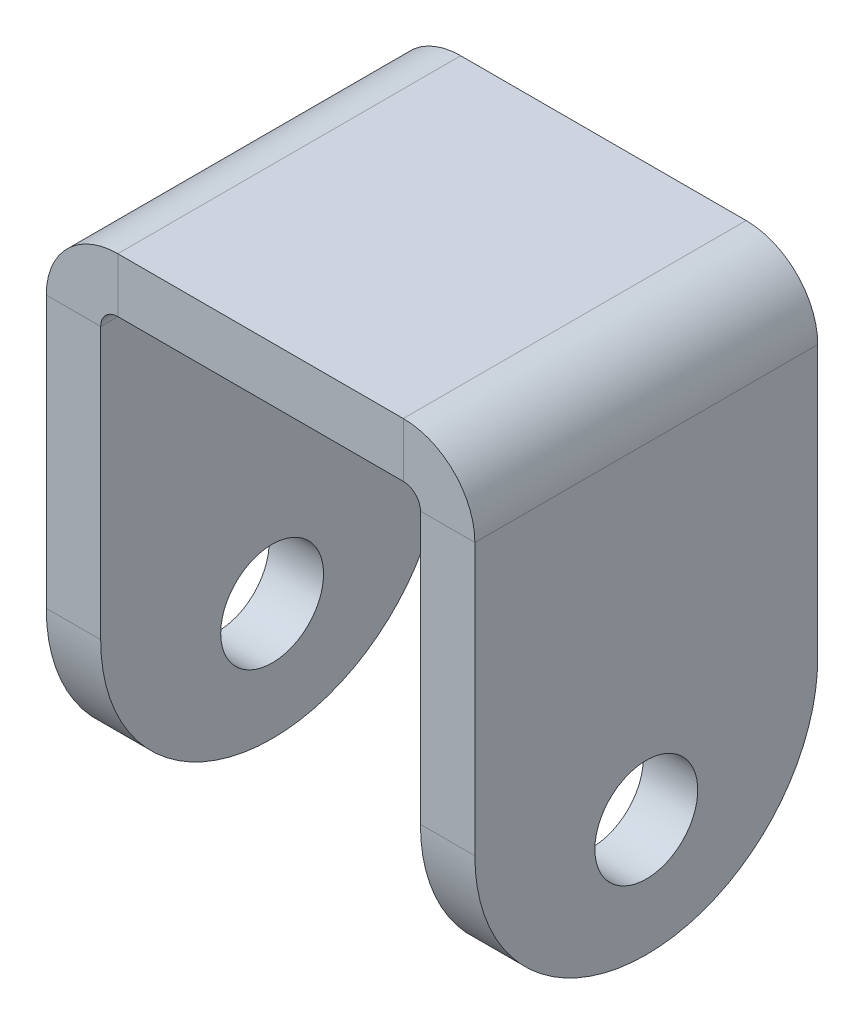
ISO-10303-21;
HEADER;
FILE_DESCRIPTION(('STEP AP214'),'2;1');
FILE_NAME('part.step','',(''),(''),'','','');
FILE_SCHEMA(('AUTOMOTIVE_DESIGN { 1 0 10303 214 1 1 1 1 }'));
ENDSEC;
DATA;
#1=APPLICATION_CONTEXT('core data for automotive mechanical design processes');
#2=APPLICATION_PROTOCOL_DEFINITION('international standard','automotive_design',2000,#1);
#3=PRODUCT_CONTEXT('',#1,'mechanical');
#4=PRODUCT('Part','Part','',(#3));
#5=PRODUCT_RELATED_PRODUCT_CATEGORY('part','',(#4));
#6=PRODUCT_DEFINITION_FORMATION('','',#4);
#7=PRODUCT_DEFINITION_CONTEXT('part definition',#1,'design');
#8=PRODUCT_DEFINITION('design','',#6,#7);
#9=PRODUCT_DEFINITION_SHAPE('','',#8);
#10=(LENGTH_UNIT() NAMED_UNIT(*) SI_UNIT(.MILLI.,.METRE.));
#11=(NAMED_UNIT(*) PLANE_ANGLE_UNIT() SI_UNIT($,.RADIAN.));
#12=(NAMED_UNIT(*) SI_UNIT($,.STERADIAN.) SOLID_ANGLE_UNIT());
#13=UNCERTAINTY_MEASURE_WITH_UNIT(LENGTH_MEASURE(1.E-05),#10,'distance_accuracy_value','');
#14=(GEOMETRIC_REPRESENTATION_CONTEXT(3) GLOBAL_UNCERTAINTY_ASSIGNED_CONTEXT((#13)) GLOBAL_UNIT_ASSIGNED_CONTEXT((#10,
#11,#12)) REPRESENTATION_CONTEXT('',''));
#15=CARTESIAN_POINT('',(0.,0.,0.));
#16=DIRECTION('',(0.,0.,1.));
#17=DIRECTION('',(1.,0.,0.));
#18=AXIS2_PLACEMENT_3D('',#15,#16,#17);
#19=CARTESIAN_POINT('',(4.175,30.,20.));
#20=DIRECTION('',(0.,0.,1.));
#21=DIRECTION('',(1.,0.,0.));
#22=AXIS2_PLACEMENT_3D('',#19,#20,#21);
#23=PLANE('',#22);
#24=DIRECTION('',(0.,-1.,0.));
#25=VECTOR('',#24,1.);
#26=CARTESIAN_POINT('',(4.175,30.,20.));
#27=LINE('',#26,#25);
#28=CARTESIAN_POINT('',(4.175,30.,20.));
#29=VERTEX_POINT('',#28);
#30=CARTESIAN_POINT('',(4.175,26.825,20.));
#31=VERTEX_POINT('',#30);
#32=EDGE_CURVE('E255',#29,#31,#27,.T.);
#33=ORIENTED_EDGE('',*,*,#32,.F.);
#34=CARTESIAN_POINT('',(4.175,25.825,20.));
#35=DIRECTION('',(0.,0.,1.));
#36=DIRECTION('',(1.,0.,0.));
#37=AXIS2_PLACEMENT_3D('',#34,#35,#36);
#38=CIRCLE('',#37,4.175);
#39=CARTESIAN_POINT('',(0.,25.825,20.));
#40=VERTEX_POINT('',#39);
#41=EDGE_CURVE('E182',#40,#29,#38,.F.);
#42=ORIENTED_EDGE('',*,*,#41,.F.);
#43=DIRECTION('',(-1.,0.,0.));
#44=VECTOR('',#43,1.);
#45=CARTESIAN_POINT('',(3.175,25.825,20.));
#46=LINE('',#45,#44);
#47=CARTESIAN_POINT('',(3.175,25.825,20.));
#48=VERTEX_POINT('',#47);
#49=EDGE_CURVE('E252',#48,#40,#46,.T.);
#50=ORIENTED_EDGE('',*,*,#49,.F.);
#51=CARTESIAN_POINT('',(4.175,25.825,20.));
#52=DIRECTION('',(0.,0.,1.));
#53=DIRECTION('',(1.,0.,0.));
#54=AXIS2_PLACEMENT_3D('',#51,#52,#53);
#55=CIRCLE('',#54,1.);
#56=EDGE_CURVE('E192',#48,#31,#55,.F.);
#57=ORIENTED_EDGE('',*,*,#56,.T.);
#58=EDGE_LOOP('',(#33,#42,#50,#57));
#59=FACE_BOUND('',#58,.T.);
#60=ADVANCED_FACE('F39',(#59),#23,.T.);
#61=CARTESIAN_POINT('',(3.175,25.825,20.));
#62=DIRECTION('',(0.,0.,1.));
#63=DIRECTION('',(1.,0.,0.));
#64=AXIS2_PLACEMENT_3D('',#61,#62,#63);
#65=PLANE('',#64);
#66=DIRECTION('',(1.,0.,0.));
#67=VECTOR('',#66,1.);
#68=CARTESIAN_POINT('',(0.,30.,20.));
#69=LINE('',#68,#67);
#70=CARTESIAN_POINT('',(20.825,30.,20.));
#71=VERTEX_POINT('',#70);
#72=EDGE_CURVE('E180',#29,#71,#69,.T.);
#73=ORIENTED_EDGE('',*,*,#72,.F.);
#74=ORIENTED_EDGE('',*,*,#32,.T.);
#75=DIRECTION('',(1.,0.,0.));
#76=VECTOR('',#75,1.);
#77=CARTESIAN_POINT('',(0.,26.825,20.));
#78=LINE('',#77,#76);
#79=CARTESIAN_POINT('',(20.825,26.825,20.));
#80=VERTEX_POINT('',#79);
#81=EDGE_CURVE('E195',#31,#80,#78,.T.);
#82=ORIENTED_EDGE('',*,*,#81,.T.);
#83=DIRECTION('',(0.,1.,0.));
#84=VECTOR('',#83,1.);
#85=CARTESIAN_POINT('',(20.825,26.825,20.));
#86=LINE('',#85,#84);
#87=EDGE_CURVE('E154',#80,#71,#86,.T.);
#88=ORIENTED_EDGE('',*,*,#87,.T.);
#89=EDGE_LOOP('',(#73,#74,#82,#88));
#90=FACE_BOUND('',#89,.T.);
#91=ADVANCED_FACE('F315',(#90),#65,.T.);
#92=CARTESIAN_POINT('',(0.,25.825,0.));
#93=DIRECTION('',(0.,0.,-1.));
#94=DIRECTION('',(-1.,0.,0.));
#95=AXIS2_PLACEMENT_3D('',#92,#93,#94);
#96=PLANE('',#95);
#97=DIRECTION('',(1.,0.,0.));
#98=VECTOR('',#97,1.);
#99=CARTESIAN_POINT('',(0.,25.825,0.));
#100=LINE('',#99,#98);
#101=CARTESIAN_POINT('',(0.,25.825,0.));
#102=VERTEX_POINT('',#101);
#103=CARTESIAN_POINT('',(3.175,25.825,0.));
#104=VERTEX_POINT('',#103);
#105=EDGE_CURVE('E249',#102,#104,#100,.T.);
#106=ORIENTED_EDGE('',*,*,#105,.F.);
#107=CARTESIAN_POINT('',(4.175,25.825,0.));
#108=DIRECTION('',(0.,0.,1.));
#109=DIRECTION('',(1.,0.,0.));
#110=AXIS2_PLACEMENT_3D('',#107,#108,#109);
#111=CIRCLE('',#110,4.175);
#112=CARTESIAN_POINT('',(4.175,30.,0.));
#113=VERTEX_POINT('',#112);
#114=EDGE_CURVE('E210',#102,#113,#111,.F.);
#115=ORIENTED_EDGE('',*,*,#114,.T.);
#116=DIRECTION('',(0.,1.,0.));
#117=VECTOR('',#116,1.);
#118=CARTESIAN_POINT('',(4.175,26.825,0.));
#119=LINE('',#118,#117);
#120=CARTESIAN_POINT('',(4.175,26.825,0.));
#121=VERTEX_POINT('',#120);
#122=EDGE_CURVE('E153',#121,#113,#119,.T.);
#123=ORIENTED_EDGE('',*,*,#122,.F.);
#124=CARTESIAN_POINT('',(4.175,25.825,0.));
#125=DIRECTION('',(0.,0.,1.));
#126=DIRECTION('',(1.,0.,0.));
#127=AXIS2_PLACEMENT_3D('',#124,#125,#126);
#128=CIRCLE('',#127,1.);
#129=EDGE_CURVE('E217',#104,#121,#128,.F.);
#130=ORIENTED_EDGE('',*,*,#129,.F.);
#131=EDGE_LOOP('',(#106,#115,#123,#130));
#132=FACE_BOUND('',#131,.T.);
#133=ADVANCED_FACE('F359',(#132),#96,.T.);
#134=CARTESIAN_POINT('',(4.175,26.825,0.));
#135=DIRECTION('',(0.,0.,-1.));
#136=DIRECTION('',(-1.,0.,0.));
#137=AXIS2_PLACEMENT_3D('',#134,#135,#136);
#138=PLANE('',#137);
#139=DIRECTION('',(0.,1.,0.));
#140=VECTOR('',#139,1.);
#141=CARTESIAN_POINT('',(3.175,0.,0.));
#142=LINE('',#141,#140);
#143=CARTESIAN_POINT('',(3.175,10.,0.));
#144=VERTEX_POINT('',#143);
#145=EDGE_CURVE('E215',#144,#104,#142,.T.);
#146=ORIENTED_EDGE('',*,*,#145,.F.);
#147=DIRECTION('',(-1.,0.,0.));
#148=VECTOR('',#147,1.);
#149=CARTESIAN_POINT('',(4.175,10.,0.));
#150=LINE('',#149,#148);
#151=CARTESIAN_POINT('',(0.,10.,0.));
#152=VERTEX_POINT('',#151);
#153=EDGE_CURVE('E272',#144,#152,#150,.T.);
#154=ORIENTED_EDGE('',*,*,#153,.T.);
#155=DIRECTION('',(0.,1.,0.));
#156=VECTOR('',#155,1.);
#157=CARTESIAN_POINT('',(0.,0.,0.));
#158=LINE('',#157,#156);
#159=EDGE_CURVE('E213',#152,#102,#158,.T.);
#160=ORIENTED_EDGE('',*,*,#159,.T.);
#161=ORIENTED_EDGE('',*,*,#105,.T.);
#162=EDGE_LOOP('',(#146,#154,#160,#161));
#163=FACE_BOUND('',#162,.T.);
#164=ADVANCED_FACE('F489',(#163),#138,.T.);
#165=CARTESIAN_POINT('',(25.,25.825,20.));
#166=DIRECTION('',(0.,0.,1.));
#167=DIRECTION('',(1.,0.,0.));
#168=AXIS2_PLACEMENT_3D('',#165,#166,#167);
#169=PLANE('',#168);
#170=DIRECTION('',(-1.,0.,0.));
#171=VECTOR('',#170,1.);
#172=CARTESIAN_POINT('',(25.,25.825,20.));
#173=LINE('',#172,#171);
#174=CARTESIAN_POINT('',(25.,25.825,20.));
#175=VERTEX_POINT('',#174);
#176=CARTESIAN_POINT('',(21.825,25.825,20.));
#177=VERTEX_POINT('',#176);
#178=EDGE_CURVE('E141',#175,#177,#173,.T.);
#179=ORIENTED_EDGE('',*,*,#178,.F.);
#180=CARTESIAN_POINT('',(20.825,25.825,20.));
#181=DIRECTION('',(0.,0.,1.));
#182=DIRECTION('',(1.,0.,0.));
#183=AXIS2_PLACEMENT_3D('',#180,#181,#182);
#184=CIRCLE('',#183,4.175);
#185=EDGE_CURVE('E145',#71,#175,#184,.F.);
#186=ORIENTED_EDGE('',*,*,#185,.F.);
#187=ORIENTED_EDGE('',*,*,#87,.F.);
#188=CARTESIAN_POINT('',(20.825,25.825,20.));
#189=DIRECTION('',(0.,0.,1.));
#190=DIRECTION('',(1.,0.,0.));
#191=AXIS2_PLACEMENT_3D('',#188,#189,#190);
#192=CIRCLE('',#191,1.);
#193=EDGE_CURVE('E148',#80,#177,#192,.F.);
#194=ORIENTED_EDGE('',*,*,#193,.T.);
#195=EDGE_LOOP('',(#179,#186,#187,#194));
#196=FACE_BOUND('',#195,.T.);
#197=ADVANCED_FACE('F143',(#196),#169,.T.);
#198=CARTESIAN_POINT('',(20.825,26.825,20.));
#199=DIRECTION('',(0.,0.,1.));
#200=DIRECTION('',(1.,0.,0.));
#201=AXIS2_PLACEMENT_3D('',#198,#199,#200);
#202=PLANE('',#201);
#203=DIRECTION('',(0.,-1.,0.));
#204=VECTOR('',#203,1.);
#205=CARTESIAN_POINT('',(21.825,30.,20.));
#206=LINE('',#205,#204);
#207=CARTESIAN_POINT('',(21.825,10.,20.));
#208=VERTEX_POINT('',#207);
#209=EDGE_CURVE('E175',#177,#208,#206,.T.);
#210=ORIENTED_EDGE('',*,*,#209,.T.);
#211=DIRECTION('',(-1.,0.,0.));
#212=VECTOR('',#211,1.);
#213=CARTESIAN_POINT('',(20.825,10.,20.));
#214=LINE('',#213,#212);
#215=CARTESIAN_POINT('',(25.,10.,20.));
#216=VERTEX_POINT('',#215);
#217=EDGE_CURVE('E174',#208,#216,#214,.F.);
#218=ORIENTED_EDGE('',*,*,#217,.T.);
#219=DIRECTION('',(0.,-1.,0.));
#220=VECTOR('',#219,1.);
#221=CARTESIAN_POINT('',(25.,30.,20.));
#222=LINE('',#221,#220);
#223=EDGE_CURVE('E162',#175,#216,#222,.T.);
#224=ORIENTED_EDGE('',*,*,#223,.F.);
#225=ORIENTED_EDGE('',*,*,#178,.T.);
#226=EDGE_LOOP('',(#210,#218,#224,#225));
#227=FACE_BOUND('',#226,.T.);
#228=ADVANCED_FACE('F172',(#227),#202,.T.);
#229=CARTESIAN_POINT('',(20.825,30.,0.));
#230=DIRECTION('',(0.,0.,-1.));
#231=DIRECTION('',(-1.,0.,0.));
#232=AXIS2_PLACEMENT_3D('',#229,#230,#231);
#233=PLANE('',#232);
#234=DIRECTION('',(0.,-1.,0.));
#235=VECTOR('',#234,1.);
#236=CARTESIAN_POINT('',(20.825,30.,0.));
#237=LINE('',#236,#235);
#238=CARTESIAN_POINT('',(20.825,30.,0.));
#239=VERTEX_POINT('',#238);
#240=CARTESIAN_POINT('',(20.825,26.825,0.));
#241=VERTEX_POINT('',#240);
#242=EDGE_CURVE('E245',#239,#241,#237,.T.);
#243=ORIENTED_EDGE('',*,*,#242,.F.);
#244=CARTESIAN_POINT('',(20.825,25.825,0.));
#245=DIRECTION('',(0.,0.,1.));
#246=DIRECTION('',(1.,0.,0.));
#247=AXIS2_PLACEMENT_3D('',#244,#245,#246);
#248=CIRCLE('',#247,4.175);
#249=CARTESIAN_POINT('',(25.,25.825,0.));
#250=VERTEX_POINT('',#249);
#251=EDGE_CURVE('E205',#239,#250,#248,.F.);
#252=ORIENTED_EDGE('',*,*,#251,.T.);
#253=DIRECTION('',(1.,0.,0.));
#254=VECTOR('',#253,1.);
#255=CARTESIAN_POINT('',(21.825,25.825,0.));
#256=LINE('',#255,#254);
#257=CARTESIAN_POINT('',(21.825,25.825,0.));
#258=VERTEX_POINT('',#257);
#259=EDGE_CURVE('E168',#258,#250,#256,.T.);
#260=ORIENTED_EDGE('',*,*,#259,.F.);
#261=CARTESIAN_POINT('',(20.825,25.825,0.));
#262=DIRECTION('',(0.,0.,1.));
#263=DIRECTION('',(1.,0.,0.));
#264=AXIS2_PLACEMENT_3D('',#261,#262,#263);
#265=CIRCLE('',#264,1.);
#266=EDGE_CURVE('E223',#241,#258,#265,.F.);
#267=ORIENTED_EDGE('',*,*,#266,.F.);
#268=EDGE_LOOP('',(#243,#252,#260,#267));
#269=FACE_BOUND('',#268,.T.);
#270=ADVANCED_FACE('F351',(#269),#233,.T.);
#271=CARTESIAN_POINT('',(21.825,25.825,0.));
#272=DIRECTION('',(0.,0.,-1.));
#273=DIRECTION('',(-1.,0.,0.));
#274=AXIS2_PLACEMENT_3D('',#271,#272,#273);
#275=PLANE('',#274);
#276=DIRECTION('',(1.,0.,0.));
#277=VECTOR('',#276,1.);
#278=CARTESIAN_POINT('',(0.,30.,0.));
#279=LINE('',#278,#277);
#280=EDGE_CURVE('E207',#113,#239,#279,.T.);
#281=ORIENTED_EDGE('',*,*,#280,.T.);
#282=ORIENTED_EDGE('',*,*,#242,.T.);
#283=DIRECTION('',(1.,0.,0.));
#284=VECTOR('',#283,1.);
#285=CARTESIAN_POINT('',(0.,26.825,0.));
#286=LINE('',#285,#284);
#287=EDGE_CURVE('E220',#121,#241,#286,.T.);
#288=ORIENTED_EDGE('',*,*,#287,.F.);
#289=ORIENTED_EDGE('',*,*,#122,.T.);
#290=EDGE_LOOP('',(#281,#282,#288,#289));
#291=FACE_BOUND('',#290,.T.);
#292=ADVANCED_FACE('F344',(#291),#275,.T.);
#293=CARTESIAN_POINT('',(21.825,30.,20.));
#294=DIRECTION('',(1.,0.,0.));
#295=DIRECTION('',(0.,1.,0.));
#296=AXIS2_PLACEMENT_3D('',#293,#294,#295);
#297=PLANE('',#296);
#298=CARTESIAN_POINT('',(21.825,6.825,10.));
#299=DIRECTION('',(1.,0.,0.));
#300=DIRECTION('',(0.,1.,0.));
#301=AXIS2_PLACEMENT_3D('',#298,#299,#300);
#302=CIRCLE('',#301,3.);
#303=CARTESIAN_POINT('',(21.825,9.825,10.));
#304=VERTEX_POINT('',#303);
#305=EDGE_CURVE('E203',#304,#304,#302,.T.);
#306=ORIENTED_EDGE('',*,*,#305,.T.);
#307=EDGE_LOOP('',(#306));
#308=FACE_BOUND('',#307,.T.);
#309=CARTESIAN_POINT('',(21.825,10.,10.));
#310=DIRECTION('',(1.,0.,0.));
#311=DIRECTION('',(0.,1.,0.));
#312=AXIS2_PLACEMENT_3D('',#309,#310,#311);
#313=CIRCLE('',#312,10.);
#314=CARTESIAN_POINT('',(21.825,10.,0.));
#315=VERTEX_POINT('',#314);
#316=CARTESIAN_POINT('',(21.825,0.,10.));
#317=VERTEX_POINT('',#316);
#318=EDGE_CURVE('E257',#315,#317,#313,.F.);
#319=ORIENTED_EDGE('',*,*,#318,.T.);
#320=CARTESIAN_POINT('',(21.825,10.,10.));
#321=DIRECTION('',(1.,0.,0.));
#322=DIRECTION('',(0.,1.,0.));
#323=AXIS2_PLACEMENT_3D('',#320,#321,#322);
#324=CIRCLE('',#323,10.);
#325=EDGE_CURVE('E263',#317,#208,#324,.F.);
#326=ORIENTED_EDGE('',*,*,#325,.T.);
#327=ORIENTED_EDGE('',*,*,#209,.F.);
#328=DIRECTION('',(0.,0.,-1.));
#329=VECTOR('',#328,1.);
#330=CARTESIAN_POINT('',(21.825,25.825,20.));
#331=LINE('',#330,#329);
#332=EDGE_CURVE('E199',#177,#258,#331,.T.);
#333=ORIENTED_EDGE('',*,*,#332,.T.);
#334=DIRECTION('',(0.,-1.,0.));
#335=VECTOR('',#334,1.);
#336=CARTESIAN_POINT('',(21.825,30.,0.));
#337=LINE('',#336,#335);
#338=EDGE_CURVE('E200',#258,#315,#337,.T.);
#339=ORIENTED_EDGE('',*,*,#338,.T.);
#340=EDGE_LOOP('',(#319,#326,#327,#333,#339));
#341=FACE_BOUND('',#340,.T.);
#342=ADVANCED_FACE('F327',(#308,#341),#297,.F.);
#343=CARTESIAN_POINT('',(25.,30.,20.));
#344=DIRECTION('',(1.,0.,0.));
#345=DIRECTION('',(0.,1.,0.));
#346=AXIS2_PLACEMENT_3D('',#343,#344,#345);
#347=PLANE('',#346);
#348=CARTESIAN_POINT('',(25.,6.825,10.));
#349=DIRECTION('',(-1.,0.,0.));
#350=DIRECTION('',(0.,0.,1.));
#351=AXIS2_PLACEMENT_3D('',#348,#349,#350);
#352=CIRCLE('',#351,3.);
#353=CARTESIAN_POINT('',(25.,6.825,13.));
#354=VERTEX_POINT('',#353);
#355=EDGE_CURVE('E261',#354,#354,#352,.T.);
#356=ORIENTED_EDGE('',*,*,#355,.T.);
#357=EDGE_LOOP('',(#356));
#358=FACE_BOUND('',#357,.T.);
#359=ORIENTED_EDGE('',*,*,#223,.T.);
#360=CARTESIAN_POINT('',(25.,10.,10.));
#361=DIRECTION('',(1.,0.,0.));
#362=DIRECTION('',(0.,1.,0.));
#363=AXIS2_PLACEMENT_3D('',#360,#361,#362);
#364=CIRCLE('',#363,10.);
#365=CARTESIAN_POINT('',(25.,0.,10.));
#366=VERTEX_POINT('',#365);
#367=EDGE_CURVE('E268',#216,#366,#364,.T.);
#368=ORIENTED_EDGE('',*,*,#367,.T.);
#369=CARTESIAN_POINT('',(25.,10.,10.));
#370=DIRECTION('',(1.,0.,0.));
#371=DIRECTION('',(0.,1.,0.));
#372=AXIS2_PLACEMENT_3D('',#369,#370,#371);
#373=CIRCLE('',#372,10.);
#374=CARTESIAN_POINT('',(25.,10.,0.));
#375=VERTEX_POINT('',#374);
#376=EDGE_CURVE('E266',#366,#375,#373,.T.);
#377=ORIENTED_EDGE('',*,*,#376,.T.);
#378=DIRECTION('',(0.,-1.,0.));
#379=VECTOR('',#378,1.);
#380=CARTESIAN_POINT('',(25.,30.,0.));
#381=LINE('',#380,#379);
#382=EDGE_CURVE('E164',#250,#375,#381,.T.);
#383=ORIENTED_EDGE('',*,*,#382,.F.);
#384=DIRECTION('',(0.,0.,-1.));
#385=VECTOR('',#384,1.);
#386=CARTESIAN_POINT('',(25.,25.825,20.));
#387=LINE('',#386,#385);
#388=EDGE_CURVE('E160',#175,#250,#387,.T.);
#389=ORIENTED_EDGE('',*,*,#388,.F.);
#390=EDGE_LOOP('',(#359,#368,#377,#383,#389));
#391=FACE_BOUND('',#390,.T.);
#392=ADVANCED_FACE('F161',(#358,#391),#347,.T.);
#393=CARTESIAN_POINT('',(20.825,25.825,20.));
#394=DIRECTION('',(0.,0.,-1.));
#395=DIRECTION('',(-1.,0.,0.));
#396=AXIS2_PLACEMENT_3D('',#393,#394,#395);
#397=CYLINDRICAL_SURFACE('',#396,4.175);
#398=ORIENTED_EDGE('',*,*,#251,.F.);
#399=DIRECTION('',(0.,0.,-1.));
#400=VECTOR('',#399,1.);
#401=CARTESIAN_POINT('',(20.825,30.,20.));
#402=LINE('',#401,#400);
#403=EDGE_CURVE('E169',#71,#239,#402,.T.);
#404=ORIENTED_EDGE('',*,*,#403,.F.);
#405=ORIENTED_EDGE('',*,*,#185,.T.);
#406=ORIENTED_EDGE('',*,*,#388,.T.);
#407=EDGE_LOOP('',(#398,#404,#405,#406));
#408=FACE_BOUND('',#407,.T.);
#409=ADVANCED_FACE('F178',(#408),#397,.T.);
#410=CARTESIAN_POINT('',(0.,30.,20.));
#411=DIRECTION('',(0.,1.,0.));
#412=DIRECTION('',(0.,0.,1.));
#413=AXIS2_PLACEMENT_3D('',#410,#411,#412);
#414=PLANE('',#413);
#415=ORIENTED_EDGE('',*,*,#280,.F.);
#416=DIRECTION('',(0.,0.,-1.));
#417=VECTOR('',#416,1.);
#418=CARTESIAN_POINT('',(4.175,30.,20.));
#419=LINE('',#418,#417);
#420=EDGE_CURVE('E240',#29,#113,#419,.T.);
#421=ORIENTED_EDGE('',*,*,#420,.F.);
#422=ORIENTED_EDGE('',*,*,#72,.T.);
#423=ORIENTED_EDGE('',*,*,#403,.T.);
#424=EDGE_LOOP('',(#415,#421,#422,#423));
#425=FACE_BOUND('',#424,.T.);
#426=ADVANCED_FACE('F314',(#425),#414,.T.);
#427=CARTESIAN_POINT('',(4.175,25.825,20.));
#428=DIRECTION('',(0.,0.,-1.));
#429=DIRECTION('',(-1.,0.,0.));
#430=AXIS2_PLACEMENT_3D('',#427,#428,#429);
#431=CYLINDRICAL_SURFACE('',#430,4.175);
#432=ORIENTED_EDGE('',*,*,#114,.F.);
#433=DIRECTION('',(0.,0.,-1.));
#434=VECTOR('',#433,1.);
#435=CARTESIAN_POINT('',(0.,25.825,20.));
#436=LINE('',#435,#434);
#437=EDGE_CURVE('E237',#40,#102,#436,.T.);
#438=ORIENTED_EDGE('',*,*,#437,.F.);
#439=ORIENTED_EDGE('',*,*,#41,.T.);
#440=ORIENTED_EDGE('',*,*,#420,.T.);
#441=EDGE_LOOP('',(#432,#438,#439,#440));
#442=FACE_BOUND('',#441,.T.);
#443=ADVANCED_FACE('F306',(#442),#431,.T.);
#444=CARTESIAN_POINT('',(0.,0.,20.));
#445=DIRECTION('',(-1.,0.,0.));
#446=DIRECTION('',(0.,0.,1.));
#447=AXIS2_PLACEMENT_3D('',#444,#445,#446);
#448=PLANE('',#447);
#449=CARTESIAN_POINT('',(0.,6.825,10.));
#450=DIRECTION('',(-1.,0.,0.));
#451=DIRECTION('',(0.,0.,1.));
#452=AXIS2_PLACEMENT_3D('',#449,#450,#451);
#453=CIRCLE('',#452,3.);
#454=CARTESIAN_POINT('',(0.,6.825,13.));
#455=VERTEX_POINT('',#454);
#456=EDGE_CURVE('E282',#455,#455,#453,.T.);
#457=ORIENTED_EDGE('',*,*,#456,.F.);
#458=EDGE_LOOP('',(#457));
#459=FACE_BOUND('',#458,.T.);
#460=ORIENTED_EDGE('',*,*,#159,.F.);
#461=CARTESIAN_POINT('',(0.,10.,10.));
#462=DIRECTION('',(-1.,0.,0.));
#463=DIRECTION('',(0.,0.,1.));
#464=AXIS2_PLACEMENT_3D('',#461,#462,#463);
#465=CIRCLE('',#464,10.);
#466=CARTESIAN_POINT('',(0.,0.,10.));
#467=VERTEX_POINT('',#466);
#468=EDGE_CURVE('E277',#152,#467,#465,.T.);
#469=ORIENTED_EDGE('',*,*,#468,.T.);
#470=CARTESIAN_POINT('',(0.,10.,10.));
#471=DIRECTION('',(-1.,0.,0.));
#472=DIRECTION('',(0.,0.,1.));
#473=AXIS2_PLACEMENT_3D('',#470,#471,#472);
#474=CIRCLE('',#473,10.);
#475=CARTESIAN_POINT('',(0.,10.,20.));
#476=VERTEX_POINT('',#475);
#477=EDGE_CURVE('E275',#467,#476,#474,.T.);
#478=ORIENTED_EDGE('',*,*,#477,.T.);
#479=DIRECTION('',(0.,1.,0.));
#480=VECTOR('',#479,1.);
#481=CARTESIAN_POINT('',(0.,0.,20.));
#482=LINE('',#481,#480);
#483=EDGE_CURVE('E188',#476,#40,#482,.T.);
#484=ORIENTED_EDGE('',*,*,#483,.T.);
#485=ORIENTED_EDGE('',*,*,#437,.T.);
#486=EDGE_LOOP('',(#460,#469,#478,#484,#485));
#487=FACE_BOUND('',#486,.T.);
#488=ADVANCED_FACE('F297',(#459,#487),#448,.T.);
#489=CARTESIAN_POINT('',(3.175,0.,20.));
#490=DIRECTION('',(-1.,0.,0.));
#491=DIRECTION('',(0.,0.,1.));
#492=AXIS2_PLACEMENT_3D('',#489,#490,#491);
#493=PLANE('',#492);
#494=CARTESIAN_POINT('',(3.175,6.825,10.));
#495=DIRECTION('',(-1.,0.,0.));
#496=DIRECTION('',(0.,0.,1.));
#497=AXIS2_PLACEMENT_3D('',#494,#495,#496);
#498=CIRCLE('',#497,3.);
#499=CARTESIAN_POINT('',(3.175,6.825,13.));
#500=VERTEX_POINT('',#499);
#501=EDGE_CURVE('E258',#500,#500,#498,.T.);
#502=ORIENTED_EDGE('',*,*,#501,.T.);
#503=EDGE_LOOP('',(#502));
#504=FACE_BOUND('',#503,.T.);
#505=CARTESIAN_POINT('',(3.175,10.,10.));
#506=DIRECTION('',(-1.,0.,0.));
#507=DIRECTION('',(0.,0.,1.));
#508=AXIS2_PLACEMENT_3D('',#505,#506,#507);
#509=CIRCLE('',#508,10.);
#510=CARTESIAN_POINT('',(3.175,10.,20.));
#511=VERTEX_POINT('',#510);
#512=CARTESIAN_POINT('',(3.175,0.,10.));
#513=VERTEX_POINT('',#512);
#514=EDGE_CURVE('E56',#511,#513,#509,.F.);
#515=ORIENTED_EDGE('',*,*,#514,.T.);
#516=CARTESIAN_POINT('',(3.175,10.,10.));
#517=DIRECTION('',(-1.,0.,0.));
#518=DIRECTION('',(0.,0.,1.));
#519=AXIS2_PLACEMENT_3D('',#516,#517,#518);
#520=CIRCLE('',#519,10.);
#521=EDGE_CURVE('E48',#513,#144,#520,.F.);
#522=ORIENTED_EDGE('',*,*,#521,.T.);
#523=ORIENTED_EDGE('',*,*,#145,.T.);
#524=DIRECTION('',(0.,0.,-1.));
#525=VECTOR('',#524,1.);
#526=CARTESIAN_POINT('',(3.175,25.825,20.));
#527=LINE('',#526,#525);
#528=EDGE_CURVE('E234',#48,#104,#527,.T.);
#529=ORIENTED_EDGE('',*,*,#528,.F.);
#530=DIRECTION('',(0.,1.,0.));
#531=VECTOR('',#530,1.);
#532=CARTESIAN_POINT('',(3.175,0.,20.));
#533=LINE('',#532,#531);
#534=EDGE_CURVE('E190',#511,#48,#533,.T.);
#535=ORIENTED_EDGE('',*,*,#534,.F.);
#536=EDGE_LOOP('',(#515,#522,#523,#529,#535));
#537=FACE_BOUND('',#536,.T.);
#538=ADVANCED_FACE('F427',(#504,#537),#493,.F.);
#539=CARTESIAN_POINT('',(4.175,25.825,20.));
#540=DIRECTION('',(0.,0.,-1.));
#541=DIRECTION('',(-1.,0.,0.));
#542=AXIS2_PLACEMENT_3D('',#539,#540,#541);
#543=CYLINDRICAL_SURFACE('',#542,1.);
#544=ORIENTED_EDGE('',*,*,#129,.T.);
#545=DIRECTION('',(0.,0.,-1.));
#546=VECTOR('',#545,1.);
#547=CARTESIAN_POINT('',(4.175,26.825,20.));
#548=LINE('',#547,#546);
#549=EDGE_CURVE('E231',#31,#121,#548,.T.);
#550=ORIENTED_EDGE('',*,*,#549,.F.);
#551=ORIENTED_EDGE('',*,*,#56,.F.);
#552=ORIENTED_EDGE('',*,*,#528,.T.);
#553=EDGE_LOOP('',(#544,#550,#551,#552));
#554=FACE_BOUND('',#553,.T.);
#555=ADVANCED_FACE('F420',(#554),#543,.F.);
#556=CARTESIAN_POINT('',(0.,26.825,20.));
#557=DIRECTION('',(0.,1.,0.));
#558=DIRECTION('',(0.,0.,1.));
#559=AXIS2_PLACEMENT_3D('',#556,#557,#558);
#560=PLANE('',#559);
#561=ORIENTED_EDGE('',*,*,#287,.T.);
#562=DIRECTION('',(0.,0.,-1.));
#563=VECTOR('',#562,1.);
#564=CARTESIAN_POINT('',(20.825,26.825,20.));
#565=LINE('',#564,#563);
#566=EDGE_CURVE('E228',#80,#241,#565,.T.);
#567=ORIENTED_EDGE('',*,*,#566,.F.);
#568=ORIENTED_EDGE('',*,*,#81,.F.);
#569=ORIENTED_EDGE('',*,*,#549,.T.);
#570=EDGE_LOOP('',(#561,#567,#568,#569));
#571=FACE_BOUND('',#570,.T.);
#572=ADVANCED_FACE('F319',(#571),#560,.F.);
#573=CARTESIAN_POINT('',(20.825,25.825,20.));
#574=DIRECTION('',(0.,0.,-1.));
#575=DIRECTION('',(-1.,0.,0.));
#576=AXIS2_PLACEMENT_3D('',#573,#574,#575);
#577=CYLINDRICAL_SURFACE('',#576,1.);
#578=ORIENTED_EDGE('',*,*,#266,.T.);
#579=ORIENTED_EDGE('',*,*,#332,.F.);
#580=ORIENTED_EDGE('',*,*,#193,.F.);
#581=ORIENTED_EDGE('',*,*,#566,.T.);
#582=EDGE_LOOP('',(#578,#579,#580,#581));
#583=FACE_BOUND('',#582,.T.);
#584=ADVANCED_FACE('F323',(#583),#577,.F.);
#585=CARTESIAN_POINT('',(20.825,25.825,20.));
#586=DIRECTION('',(0.,0.,1.));
#587=DIRECTION('',(1.,0.,0.));
#588=AXIS2_PLACEMENT_3D('',#585,#586,#587);
#589=PLANE('',#588);
#590=ORIENTED_EDGE('',*,*,#483,.F.);
#591=DIRECTION('',(-1.,0.,0.));
#592=VECTOR('',#591,1.);
#593=CARTESIAN_POINT('',(20.825,10.,20.));
#594=LINE('',#593,#592);
#595=EDGE_CURVE('E11',#476,#511,#594,.F.);
#596=ORIENTED_EDGE('',*,*,#595,.T.);
#597=ORIENTED_EDGE('',*,*,#534,.T.);
#598=ORIENTED_EDGE('',*,*,#49,.T.);
#599=EDGE_LOOP('',(#590,#596,#597,#598));
#600=FACE_BOUND('',#599,.T.);
#601=ADVANCED_FACE('F298',(#600),#589,.T.);
#602=CARTESIAN_POINT('',(20.825,25.825,0.));
#603=DIRECTION('',(0.,0.,1.));
#604=DIRECTION('',(1.,0.,0.));
#605=AXIS2_PLACEMENT_3D('',#602,#603,#604);
#606=PLANE('',#605);
#607=ORIENTED_EDGE('',*,*,#382,.T.);
#608=DIRECTION('',(-1.,0.,0.));
#609=VECTOR('',#608,1.);
#610=CARTESIAN_POINT('',(21.825,10.,0.));
#611=LINE('',#610,#609);
#612=EDGE_CURVE('E270',#375,#315,#611,.T.);
#613=ORIENTED_EDGE('',*,*,#612,.T.);
#614=ORIENTED_EDGE('',*,*,#338,.F.);
#615=ORIENTED_EDGE('',*,*,#259,.T.);
#616=EDGE_LOOP('',(#607,#613,#614,#615));
#617=FACE_BOUND('',#616,.T.);
#618=ADVANCED_FACE('F394',(#617),#606,.F.);
#619=CARTESIAN_POINT('',(25.,6.825,10.));
#620=DIRECTION('',(-1.,0.,0.));
#621=DIRECTION('',(0.,0.,1.));
#622=AXIS2_PLACEMENT_3D('',#619,#620,#621);
#623=CYLINDRICAL_SURFACE('',#622,3.);
#624=ORIENTED_EDGE('',*,*,#456,.T.);
#625=EDGE_LOOP('',(#624));
#626=FACE_BOUND('',#625,.T.);
#627=ORIENTED_EDGE('',*,*,#501,.F.);
#628=EDGE_LOOP('',(#627));
#629=FACE_BOUND('',#628,.T.);
#630=ADVANCED_FACE('F339',(#626,#629),#623,.F.);
#631=ORIENTED_EDGE('',*,*,#355,.F.);
#632=EDGE_LOOP('',(#631));
#633=FACE_BOUND('',#632,.T.);
#634=ORIENTED_EDGE('',*,*,#305,.F.);
#635=EDGE_LOOP('',(#634));
#636=FACE_BOUND('',#635,.T.);
#637=ADVANCED_FACE('F335',(#633,#636),#623,.F.);
#638=CARTESIAN_POINT('',(20.825,10.,10.));
#639=DIRECTION('',(1.,0.,0.));
#640=DIRECTION('',(0.,0.,-1.));
#641=AXIS2_PLACEMENT_3D('',#638,#639,#640);
#642=CYLINDRICAL_SURFACE('',#641,10.);
#643=ORIENTED_EDGE('',*,*,#612,.F.);
#644=ORIENTED_EDGE('',*,*,#376,.F.);
#645=DIRECTION('',(-1.,0.,0.));
#646=VECTOR('',#645,1.);
#647=CARTESIAN_POINT('',(25.,0.,10.));
#648=LINE('',#647,#646);
#649=EDGE_CURVE('E280',#317,#366,#648,.F.);
#650=ORIENTED_EDGE('',*,*,#649,.F.);
#651=ORIENTED_EDGE('',*,*,#318,.F.);
#652=EDGE_LOOP('',(#643,#644,#650,#651));
#653=FACE_BOUND('',#652,.T.);
#654=ADVANCED_FACE('F338',(#653),#642,.T.);
#655=CARTESIAN_POINT('',(25.,10.,10.));
#656=DIRECTION('',(-1.,0.,0.));
#657=DIRECTION('',(0.,0.,1.));
#658=AXIS2_PLACEMENT_3D('',#655,#656,#657);
#659=CYLINDRICAL_SURFACE('',#658,10.);
#660=ORIENTED_EDGE('',*,*,#367,.F.);
#661=ORIENTED_EDGE('',*,*,#217,.F.);
#662=ORIENTED_EDGE('',*,*,#325,.F.);
#663=ORIENTED_EDGE('',*,*,#649,.T.);
#664=EDGE_LOOP('',(#660,#661,#662,#663));
#665=FACE_BOUND('',#664,.T.);
#666=ADVANCED_FACE('F363',(#665),#659,.T.);
#667=CARTESIAN_POINT('',(3.175,10.,10.));
#668=DIRECTION('',(-1.,0.,0.));
#669=DIRECTION('',(0.,0.,1.));
#670=AXIS2_PLACEMENT_3D('',#667,#668,#669);
#671=CYLINDRICAL_SURFACE('',#670,10.);
#672=DIRECTION('',(-1.,0.,0.));
#673=VECTOR('',#672,1.);
#674=CARTESIAN_POINT('',(3.175,0.,10.));
#675=LINE('',#674,#673);
#676=EDGE_CURVE('E43',#513,#467,#675,.T.);
#677=ORIENTED_EDGE('',*,*,#676,.F.);
#678=ORIENTED_EDGE('',*,*,#514,.F.);
#679=ORIENTED_EDGE('',*,*,#595,.F.);
#680=ORIENTED_EDGE('',*,*,#477,.F.);
#681=EDGE_LOOP('',(#677,#678,#679,#680));
#682=FACE_BOUND('',#681,.T.);
#683=ADVANCED_FACE('F41',(#682),#671,.T.);
#684=CARTESIAN_POINT('',(4.175,10.,10.));
#685=DIRECTION('',(-1.,0.,0.));
#686=DIRECTION('',(0.,0.,1.));
#687=AXIS2_PLACEMENT_3D('',#684,#685,#686);
#688=CYLINDRICAL_SURFACE('',#687,10.);
#689=ORIENTED_EDGE('',*,*,#521,.F.);
#690=ORIENTED_EDGE('',*,*,#676,.T.);
#691=ORIENTED_EDGE('',*,*,#468,.F.);
#692=ORIENTED_EDGE('',*,*,#153,.F.);
#693=EDGE_LOOP('',(#689,#690,#691,#692));
#694=FACE_BOUND('',#693,.T.);
#695=ADVANCED_FACE('F291',(#694),#688,.T.);
#696=CLOSED_SHELL('',(#60,#91,#133,#164,#197,#228,#270,#292,#342,#392,#409,#426,#443,#488,#538,
#555,#572,#584,#601,#618,#630,#637,#654,#666,#683,#695));
#697=MANIFOLD_SOLID_BREP('B2',#696);
#698=ADVANCED_BREP_SHAPE_REPRESENTATION('',(#18,#697),#14);
#699=SHAPE_DEFINITION_REPRESENTATION(#9,#698);
ENDSEC;
END-ISO-10303-21;
